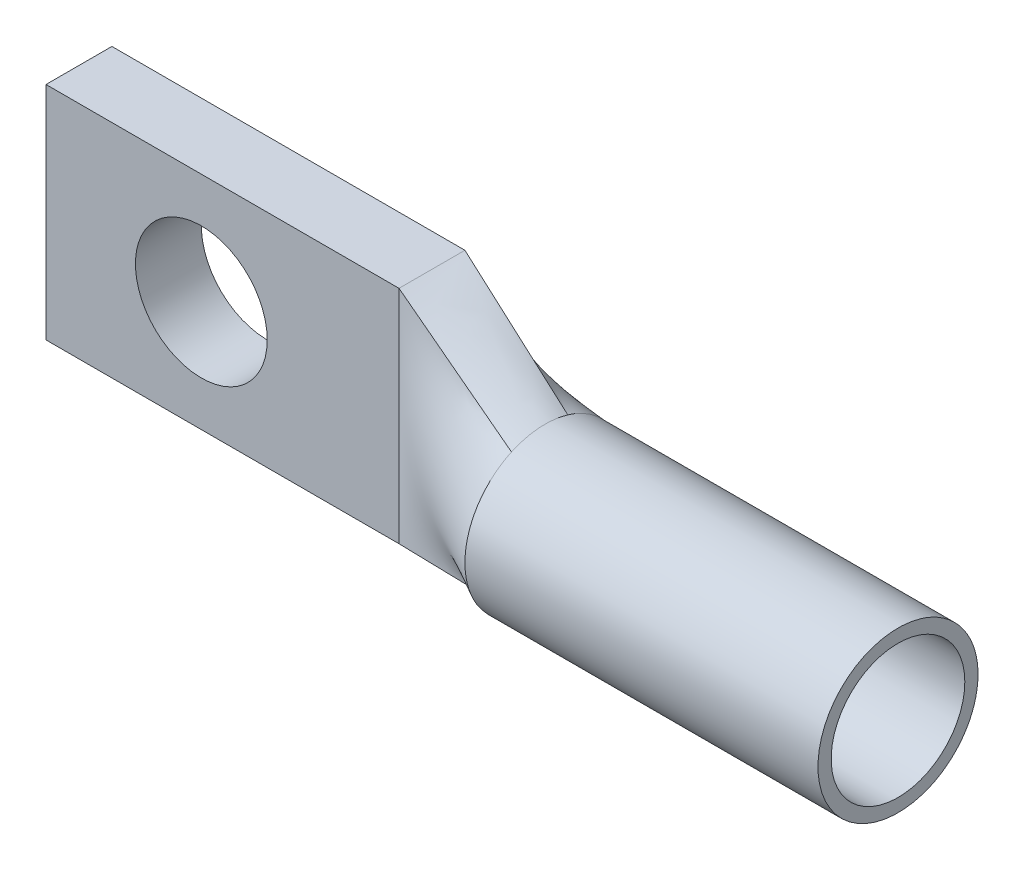
ISO-10303-21;
HEADER;
FILE_DESCRIPTION(('STEP AP214'),'2;1');
FILE_NAME('part.step','',(''),(''),'','','');
FILE_SCHEMA(('AUTOMOTIVE_DESIGN { 1 0 10303 214 1 1 1 1 }'));
ENDSEC;
DATA;
#1=APPLICATION_CONTEXT('core data for automotive mechanical design processes');
#2=APPLICATION_PROTOCOL_DEFINITION('international standard','automotive_design',2000,#1);
#3=PRODUCT_CONTEXT('',#1,'mechanical');
#4=PRODUCT('Part','Part','',(#3));
#5=PRODUCT_RELATED_PRODUCT_CATEGORY('part','',(#4));
#6=PRODUCT_DEFINITION_FORMATION('','',#4);
#7=PRODUCT_DEFINITION_CONTEXT('part definition',#1,'design');
#8=PRODUCT_DEFINITION('design','',#6,#7);
#9=PRODUCT_DEFINITION_SHAPE('','',#8);
#10=(LENGTH_UNIT() NAMED_UNIT(*) SI_UNIT(.MILLI.,.METRE.));
#11=(NAMED_UNIT(*) PLANE_ANGLE_UNIT() SI_UNIT($,.RADIAN.));
#12=(NAMED_UNIT(*) SI_UNIT($,.STERADIAN.) SOLID_ANGLE_UNIT());
#13=UNCERTAINTY_MEASURE_WITH_UNIT(LENGTH_MEASURE(1.E-05),#10,'distance_accuracy_value','');
#14=(GEOMETRIC_REPRESENTATION_CONTEXT(3) GLOBAL_UNCERTAINTY_ASSIGNED_CONTEXT((#13)) GLOBAL_UNIT_ASSIGNED_CONTEXT((#10,
#11,#12)) REPRESENTATION_CONTEXT('',''));
#15=CARTESIAN_POINT('',(0.,0.,0.));
#16=DIRECTION('',(0.,0.,1.));
#17=DIRECTION('',(1.,0.,0.));
#18=AXIS2_PLACEMENT_3D('',#15,#16,#17);
#19=CARTESIAN_POINT('',(-26.9130146414763,9.54872491124754,0.));
#20=DIRECTION('',(-1.,0.,0.));
#21=DIRECTION('',(0.,0.,1.));
#22=AXIS2_PLACEMENT_3D('',#19,#20,#21);
#23=PLANE('',#22);
#24=DIRECTION('',(0.,1.,0.));
#25=VECTOR('',#24,1.);
#26=CARTESIAN_POINT('',(-26.9130146414763,3.57972491124754,0.));
#27=LINE('',#26,#25);
#28=CARTESIAN_POINT('',(-26.9130146414763,9.54872491124754,0.));
#29=VERTEX_POINT('',#28);
#30=CARTESIAN_POINT('',(-26.9130146414763,-2.38927508875246,0.));
#31=VERTEX_POINT('',#30);
#32=EDGE_CURVE('E156',#29,#31,#27,.F.);
#33=ORIENTED_EDGE('',*,*,#32,.F.);
#34=DIRECTION('',(0.,0.,1.));
#35=VECTOR('',#34,1.);
#36=CARTESIAN_POINT('',(-26.9130146414763,9.54872491124754,0.));
#37=LINE('',#36,#35);
#38=CARTESIAN_POINT('',(-26.9130146414763,9.54872491124754,-3.556));
#39=VERTEX_POINT('',#38);
#40=EDGE_CURVE('E118',#39,#29,#37,.T.);
#41=ORIENTED_EDGE('',*,*,#40,.F.);
#42=DIRECTION('',(0.,1.,0.));
#43=VECTOR('',#42,1.);
#44=CARTESIAN_POINT('',(-26.9130146414763,3.57972491124754,-3.556));
#45=LINE('',#44,#43);
#46=CARTESIAN_POINT('',(-26.9130146414763,-2.38927508875246,-3.556));
#47=VERTEX_POINT('',#46);
#48=EDGE_CURVE('E113',#39,#47,#45,.F.);
#49=ORIENTED_EDGE('',*,*,#48,.T.);
#50=DIRECTION('',(0.,0.,-1.));
#51=VECTOR('',#50,1.);
#52=CARTESIAN_POINT('',(-26.9130146414763,-2.38927508875246,0.));
#53=LINE('',#52,#51);
#54=EDGE_CURVE('E116',#31,#47,#53,.T.);
#55=ORIENTED_EDGE('',*,*,#54,.F.);
#56=EDGE_LOOP('',(#33,#41,#49,#55));
#57=FACE_BOUND('',#56,.T.);
#58=ADVANCED_FACE('F40',(#57),#23,.T.);
#59=CARTESIAN_POINT('',(-26.9130146414763,-2.38927508875246,0.));
#60=DIRECTION('',(0.,-1.,0.));
#61=DIRECTION('',(0.,0.,-1.));
#62=AXIS2_PLACEMENT_3D('',#59,#60,#61);
#63=PLANE('',#62);
#64=DIRECTION('',(1.,0.,0.));
#65=VECTOR('',#64,1.);
#66=CARTESIAN_POINT('',(-17.3880146414763,-2.38927508875246,0.));
#67=LINE('',#66,#65);
#68=CARTESIAN_POINT('',(-7.86301464147627,-2.38927508875246,0.));
#69=VERTEX_POINT('',#68);
#70=EDGE_CURVE('E130',#31,#69,#67,.T.);
#71=ORIENTED_EDGE('',*,*,#70,.F.);
#72=ORIENTED_EDGE('',*,*,#54,.T.);
#73=DIRECTION('',(1.,0.,0.));
#74=VECTOR('',#73,1.);
#75=CARTESIAN_POINT('',(-17.3880146414763,-2.38927508875246,-3.556));
#76=LINE('',#75,#74);
#77=CARTESIAN_POINT('',(-7.86301464147627,-2.38927508875246,-3.556));
#78=VERTEX_POINT('',#77);
#79=EDGE_CURVE('E123',#47,#78,#76,.T.);
#80=ORIENTED_EDGE('',*,*,#79,.T.);
#81=DIRECTION('',(0.,0.,1.));
#82=VECTOR('',#81,1.);
#83=CARTESIAN_POINT('',(-7.86301464147627,-2.38927508875247,-1.778));
#84=LINE('',#83,#82);
#85=EDGE_CURVE('E159',#78,#69,#84,.T.);
#86=ORIENTED_EDGE('',*,*,#85,.T.);
#87=EDGE_LOOP('',(#71,#72,#80,#86));
#88=FACE_BOUND('',#87,.T.);
#89=ADVANCED_FACE('F127',(#88),#63,.T.);
#90=CARTESIAN_POINT('',(-17.3880146414763,3.57972491124754,-3.556));
#91=DIRECTION('',(0.,0.,1.));
#92=DIRECTION('',(1.,0.,0.));
#93=AXIS2_PLACEMENT_3D('',#90,#91,#92);
#94=PLANE('',#93);
#95=CARTESIAN_POINT('',(-18.5310146414763,3.57972491124754,-3.556));
#96=DIRECTION('',(0.,0.,1.));
#97=DIRECTION('',(1.,0.,0.));
#98=AXIS2_PLACEMENT_3D('',#95,#96,#97);
#99=CIRCLE('',#98,3.55600000000001);
#100=CARTESIAN_POINT('',(-14.9750146414762,3.57972491124754,-3.556));
#101=VERTEX_POINT('',#100);
#102=EDGE_CURVE('E416',#101,#101,#99,.T.);
#103=ORIENTED_EDGE('',*,*,#102,.T.);
#104=EDGE_LOOP('',(#103));
#105=FACE_BOUND('',#104,.T.);
#106=ORIENTED_EDGE('',*,*,#79,.F.);
#107=ORIENTED_EDGE('',*,*,#48,.F.);
#108=DIRECTION('',(1.,0.,0.));
#109=VECTOR('',#108,1.);
#110=CARTESIAN_POINT('',(-7.86301464147627,9.54872491124754,-3.556));
#111=LINE('',#110,#109);
#112=CARTESIAN_POINT('',(-7.86301464147627,9.54872491124755,-3.55599999999999));
#113=VERTEX_POINT('',#112);
#114=EDGE_CURVE('E139',#113,#39,#111,.F.);
#115=ORIENTED_EDGE('',*,*,#114,.F.);
#116=DIRECTION('',(0.,-1.,0.));
#117=VECTOR('',#116,1.);
#118=CARTESIAN_POINT('',(-7.86301464147627,3.57972491124754,-3.556));
#119=LINE('',#118,#117);
#120=EDGE_CURVE('E137',#113,#78,#119,.T.);
#121=ORIENTED_EDGE('',*,*,#120,.T.);
#122=EDGE_LOOP('',(#106,#107,#115,#121));
#123=FACE_BOUND('',#122,.T.);
#124=ADVANCED_FACE('F135',(#105,#123),#94,.F.);
#125=CARTESIAN_POINT('',(-7.86301464147627,9.54872491124754,0.));
#126=DIRECTION('',(0.,1.,0.));
#127=DIRECTION('',(0.,0.,1.));
#128=AXIS2_PLACEMENT_3D('',#125,#126,#127);
#129=PLANE('',#128);
#130=DIRECTION('',(1.,0.,0.));
#131=VECTOR('',#130,1.);
#132=CARTESIAN_POINT('',(-17.3880146414763,9.54872491124754,0.));
#133=LINE('',#132,#131);
#134=CARTESIAN_POINT('',(-7.86301464147627,9.54872491124755,0.));
#135=VERTEX_POINT('',#134);
#136=EDGE_CURVE('E160',#135,#29,#133,.F.);
#137=ORIENTED_EDGE('',*,*,#136,.F.);
#138=DIRECTION('',(0.,0.,-1.));
#139=VECTOR('',#138,1.);
#140=CARTESIAN_POINT('',(-7.86301464147627,9.54872491124754,-1.778));
#141=LINE('',#140,#139);
#142=EDGE_CURVE('E300',#135,#113,#141,.T.);
#143=ORIENTED_EDGE('',*,*,#142,.T.);
#144=ORIENTED_EDGE('',*,*,#114,.T.);
#145=ORIENTED_EDGE('',*,*,#40,.T.);
#146=EDGE_LOOP('',(#137,#143,#144,#145));
#147=FACE_BOUND('',#146,.T.);
#148=ADVANCED_FACE('F401',(#147),#129,.T.);
#149=CARTESIAN_POINT('',(-17.3880146414763,3.57972491124754,0.));
#150=DIRECTION('',(0.,0.,1.));
#151=DIRECTION('',(1.,0.,0.));
#152=AXIS2_PLACEMENT_3D('',#149,#150,#151);
#153=PLANE('',#152);
#154=CARTESIAN_POINT('',(-18.5310146414763,3.57972491124754,0.));
#155=DIRECTION('',(0.,0.,1.));
#156=DIRECTION('',(1.,0.,0.));
#157=AXIS2_PLACEMENT_3D('',#154,#155,#156);
#158=CIRCLE('',#157,3.55600000000001);
#159=CARTESIAN_POINT('',(-14.9750146414762,3.57972491124754,0.));
#160=VERTEX_POINT('',#159);
#161=EDGE_CURVE('E421',#160,#160,#158,.T.);
#162=ORIENTED_EDGE('',*,*,#161,.F.);
#163=EDGE_LOOP('',(#162));
#164=FACE_BOUND('',#163,.T.);
#165=ORIENTED_EDGE('',*,*,#136,.T.);
#166=ORIENTED_EDGE('',*,*,#32,.T.);
#167=ORIENTED_EDGE('',*,*,#70,.T.);
#168=DIRECTION('',(0.,1.,0.));
#169=VECTOR('',#168,1.);
#170=CARTESIAN_POINT('',(-7.86301464147627,3.57972491124754,0.));
#171=LINE('',#170,#169);
#172=EDGE_CURVE('E250',#69,#135,#171,.T.);
#173=ORIENTED_EDGE('',*,*,#172,.T.);
#174=EDGE_LOOP('',(#165,#166,#167,#173));
#175=FACE_BOUND('',#174,.T.);
#176=ADVANCED_FACE('F399',(#164,#175),#153,.T.);
#177=CARTESIAN_POINT('',(-7.86301464147627,-2.38927508875246,-3.556));
#178=CARTESIAN_POINT('',(-4.98434797480961,-1.77904488266098,-2.52756263364651));
#179=CARTESIAN_POINT('',(-2.10568130814296,-1.16881467656948,-1.499125267293));
#180=CARTESIAN_POINT('',(0.772985358523727,-0.558584470477974,-0.470687900939511));
#181=CARTESIAN_POINT('',(-7.86301464147627,-2.38927508875246,-2.87866666666666));
#182=CARTESIAN_POINT('',(-4.98434797480961,-1.82445116110742,-1.92388654616813));
#183=CARTESIAN_POINT('',(-2.10568130814293,-1.25935798810563,-0.969065826496424));
#184=CARTESIAN_POINT('',(0.772985358523727,-0.694534060460597,-0.014285705997873));
#185=CARTESIAN_POINT('',(-7.86301464147627,-2.38927508875248,-1.69333333333334));
#186=CARTESIAN_POINT('',(-4.98434797480961,-1.85914511701632,-0.854218296992577));
#187=CARTESIAN_POINT('',(-2.10568130814296,-1.32916088832101,-0.0151097751119362));
#188=CARTESIAN_POINT('',(0.772985358523727,-0.799030916584856,0.824005261228828));
#189=CARTESIAN_POINT('',(-7.86301464147627,-2.38927508875246,-0.508));
#190=CARTESIAN_POINT('',(-4.98434797480961,-1.8130414794771,0.212137821083555));
#191=CARTESIAN_POINT('',(-2.10568130814296,-1.2367802722403,0.932248433649721));
#192=CARTESIAN_POINT('',(0.772985358523727,-0.660546662964941,1.65238625473328));
#193=CARTESIAN_POINT('',(-7.86301464147627,-2.38927508875246,0.));
#194=CARTESIAN_POINT('',(-4.98434797480961,-1.77904488266098,0.664895966979829));
#195=CARTESIAN_POINT('',(-2.10568130814296,-1.16881467656948,1.32979193395968));
#196=CARTESIAN_POINT('',(0.772985358523727,-0.558584470477974,1.99468790093951));
#197=B_SPLINE_SURFACE_WITH_KNOTS('',3,3,((#177,#178,#179,#180),(#181,#182,#183,#184),(#185,#186,
#187,#188),(#189,#190,#191,#192),(#193,#194,#195,#196)),.UNSPECIFIED.,.F.,.F.,.F.,(4,1,4),(4,4),
(0.,0.571428571428571,1.),(0.,1.),.UNSPECIFIED.);
#198=DIRECTION('',(0.923485450897874,0.19576379702081,0.329925988300323));
#199=VECTOR('',#198,1.);
#200=CARTESIAN_POINT('',(-3.54501464147628,-1.47392977961521,-2.01334395046975));
#201=LINE('',#200,#199);
#202=CARTESIAN_POINT('',(0.772985358523727,-0.55858447047797,-0.470687900939503));
#203=VERTEX_POINT('',#202);
#204=EDGE_CURVE('E291',#78,#203,#201,.T.);
#205=CARTESIAN_POINT('',(0.772985358523727,-0.558584470477974,-0.470687900939511));
#206=CARTESIAN_POINT('',(0.772985358523727,-0.694534060460597,-0.014285705997873));
#207=CARTESIAN_POINT('',(0.772985358523727,-0.799030916584856,0.824005261228828));
#208=CARTESIAN_POINT('',(0.772985358523727,-0.660546662964941,1.65238625473328));
#209=CARTESIAN_POINT('',(0.772985358523727,-0.558584470477974,1.99468790093951));
#210=B_SPLINE_CURVE_WITH_KNOTS('',3,(#205,#206,#207,#208,#209),.UNSPECIFIED.,.F.,.F.,(4,1,4),
(0.,0.571428571428571,1.),.UNSPECIFIED.);
#211=CARTESIAN_POINT('',(0.772985358523728,-0.558584470477971,1.99468790093951));
#212=VERTEX_POINT('',#211);
#213=EDGE_CURVE('E240',#212,#203,#210,.F.);
#214=DIRECTION('',(-0.95420635464948,-0.20227612567794,-0.220396464870184));
#215=VECTOR('',#214,1.);
#216=CARTESIAN_POINT('',(-3.54501464147628,-1.47392977961523,0.997343950469751));
#217=LINE('',#216,#215);
#218=EDGE_CURVE('E256',#212,#69,#217,.T.);
#219=ORIENTED_EDGE('',*,*,#204,.T.);
#220=ORIENTED_EDGE('',*,*,#213,.F.);
#221=ORIENTED_EDGE('',*,*,#218,.T.);
#222=ORIENTED_EDGE('',*,*,#85,.F.);
#223=EDGE_LOOP('',(#219,#220,#221,#222));
#224=FACE_BOUND('',#223,.T.);
#225=ADVANCED_FACE('F290',(#224),#197,.F.);
#226=CARTESIAN_POINT('',(-7.86301464147627,9.54872491124754,-3.556));
#227=CARTESIAN_POINT('',(-5.80682416528579,9.11284619261074,-2.82140188117609));
#228=CARTESIAN_POINT('',(-2.92815749861914,8.50261598651926,-1.79296451482257));
#229=CARTESIAN_POINT('',(-0.049490831952479,7.89238578042775,-0.764527148469086));
#230=CARTESIAN_POINT('',(0.772985358523727,7.71803429297303,-0.470687900939511));
#231=CARTESIAN_POINT('',(-7.86301464147627,9.26448681600943,-3.556));
#232=CARTESIAN_POINT('',(-5.80682416528579,8.89121093440309,-2.83830552964807));
#233=CARTESIAN_POINT('',(-2.92815749861914,8.36873169182097,-1.83356864729985));
#234=CARTESIAN_POINT('',(-0.049490831952479,7.84618287920159,-0.828808762041543));
#235=CARTESIAN_POINT('',(0.772985358523727,7.69687252655906,-0.541730973900782));
#236=CARTESIAN_POINT('',(-7.86301464147627,8.69601062553325,-3.556));
#237=CARTESIAN_POINT('',(-5.80682416528579,8.44171105621816,-2.89097698580464));
#238=CARTESIAN_POINT('',(-2.92815749861914,8.08565240716396,-1.95993651317235));
#239=CARTESIAN_POINT('',(-0.049490831952479,7.72961928125653,-1.02890140679665));
#240=CARTESIAN_POINT('',(0.772985358523727,7.6278994535305,-0.762892201118515));
#241=CARTESIAN_POINT('',(-7.86301464147627,7.84329633981895,-3.556));
#242=CARTESIAN_POINT('',(-5.80682416528579,7.7386826265043,-3.0136726578441));
#243=CARTESIAN_POINT('',(-2.92815749861914,7.59229598776747,-2.25440178901738));
#244=CARTESIAN_POINT('',(-0.049490831952479,7.44586216783087,-1.49513910656135));
#245=CARTESIAN_POINT('',(0.772985358523727,7.40401668250499,-1.27820816969899));
#246=CARTESIAN_POINT('',(-7.86301464147627,6.99058205410468,-3.556));
#247=CARTESIAN_POINT('',(-5.80682416528579,6.99481324780753,-3.16283937494644));
#248=CARTESIAN_POINT('',(-2.92815749861914,7.00069931193934,-2.61242344811388));
#249=CARTESIAN_POINT('',(-0.049490831952479,7.00660982960197,-2.0620017027949));
#250=CARTESIAN_POINT('',(0.772985358523727,7.0083023070831,-1.90473745277346));
#251=CARTESIAN_POINT('',(-7.86301464147627,6.13786776839038,-3.556));
#252=CARTESIAN_POINT('',(-5.80682416528579,6.20111424522799,-3.31638767685563));
#253=CARTESIAN_POINT('',(-2.92815749861914,6.28963350657801,-2.98096285423814));
#254=CARTESIAN_POINT('',(-0.049490831952479,6.37816954811215,-2.64551694454542));
#255=CARTESIAN_POINT('',(0.772985358523727,6.4034681388472,-2.54967201528765));
#256=CARTESIAN_POINT('',(-7.86301464147627,5.28515348267611,-3.556));
#257=CARTESIAN_POINT('',(-5.80682416528579,5.35646375526414,-3.44941250922374));
#258=CARTESIAN_POINT('',(-2.92815749861914,5.45625796034488,-3.30014879414651));
#259=CARTESIAN_POINT('',(-0.049490831952479,5.55607828973646,-3.15091188707144));
#260=CARTESIAN_POINT('',(0.772985358523727,5.58460239877167,-3.10827689076094));
#261=CARTESIAN_POINT('',(-7.86301464147627,4.43243919696181,-3.556));
#262=CARTESIAN_POINT('',(-5.80682416528579,4.47015112387027,-3.53844153310004));
#263=CARTESIAN_POINT('',(-2.92815749861914,4.52299635946526,-3.51402367200728));
#264=CARTESIAN_POINT('',(-0.049490831952479,4.57581003386277,-3.48949917673117));
#265=CARTESIAN_POINT('',(0.772985358523727,4.59089480462617,-3.48247578997119));
#266=CARTESIAN_POINT('',(-7.86301464147627,3.57972491124754,-3.556));
#267=CARTESIAN_POINT('',(-5.80682416528579,3.56115235888259,-3.56685178090021));
#268=CARTESIAN_POINT('',(-2.92815749861914,3.53514819574111,-3.58193353918644));
#269=CARTESIAN_POINT('',(-0.049490831952479,3.50914571660563,-3.59708730155025));
#270=CARTESIAN_POINT('',(0.772985358523727,3.50171669565964,-3.60142801391034));
#271=CARTESIAN_POINT('',(-7.86301464147627,2.72701062553325,-3.556));
#272=CARTESIAN_POINT('',(-5.80682416528579,2.65409191796643,-3.52927288343374));
#273=CARTESIAN_POINT('',(-2.92815749861914,2.55196924889473,-3.49194012611279));
#274=CARTESIAN_POINT('',(-0.049490831952479,2.44987029951226,-3.45455196470422));
#275=CARTESIAN_POINT('',(0.772985358523727,2.42070281648555,-3.44386111807773));
#276=CARTESIAN_POINT('',(-7.86301464147627,1.87429633981895,-3.556));
#277=CARTESIAN_POINT('',(-5.80682416528579,1.77309285924948,-3.43302460839646));
#278=CARTESIAN_POINT('',(-2.92815749861914,1.63143820635981,-3.26082737344656));
#279=CARTESIAN_POINT('',(-0.049490831952479,1.48976390334073,-3.08865074239332));
#280=CARTESIAN_POINT('',(0.772985358523727,1.44928251111295,-3.03946058575191));
#281=CARTESIAN_POINT('',(-7.86301464147627,1.02158205410468,-3.556));
#282=CARTESIAN_POINT('',(-5.80682416528579,0.935799468979056,-3.29616658398194));
#283=CARTESIAN_POINT('',(-2.92815749861914,0.815693821492,-2.93241945681674));
#284=CARTESIAN_POINT('',(-0.049490831952479,0.695594694792995,-2.56865954905643));
#285=CARTESIAN_POINT('',(0.772985358523727,0.661281660742745,-2.46472618264921));
#286=CARTESIAN_POINT('',(-7.86301464147627,0.168867768390382,-3.556));
#287=CARTESIAN_POINT('',(-5.80682416528579,0.149844104265447,-3.14271329995362));
#288=CARTESIAN_POINT('',(-2.92815749861914,0.123226736379435,-2.5641370876414));
#289=CARTESIAN_POINT('',(-0.049490831952479,0.0965991195158018,-1.98554451030238));
#290=CARTESIAN_POINT('',(0.772985358523727,0.0889896538658278,-1.82022983028383));
#291=CARTESIAN_POINT('',(-7.86301464147627,-0.541727469704844,-3.556));
#292=CARTESIAN_POINT('',(-5.80682416528579,-0.464463197391432,-3.0216103481077));
#293=CARTESIAN_POINT('',(-2.92815749861914,-0.356329417529605,-2.27347460833956));
#294=CARTESIAN_POINT('',(-0.049490831952479,-0.248172098160272,-1.5253325138737));
#295=CARTESIAN_POINT('',(0.772985358523727,-0.217266389234907,-1.31157665311678));
#296=CARTESIAN_POINT('',(-7.86301464147627,-1.11020366018105,-3.556));
#297=CARTESIAN_POINT('',(-5.80682416528579,-0.936368644750532,-2.93945232054065));
#298=CARTESIAN_POINT('',(-2.92815749861914,-0.693056369003489,-2.07628213620786));
#299=CARTESIAN_POINT('',(-0.049490831952479,-0.449707194950131,-1.21311418420015));
#300=CARTESIAN_POINT('',(0.772985358523727,-0.380173188777908,-0.966495112416399));
#301=CARTESIAN_POINT('',(-7.86301464147627,-1.67867985065723,-3.556));
#302=CARTESIAN_POINT('',(-5.80682416528579,-1.3972745941928,-2.86991641256047));
#303=CARTESIAN_POINT('',(-2.92815749861914,-1.00331070289376,-1.90941764513731));
#304=CARTESIAN_POINT('',(-0.049490831952479,-0.609344556731436,-0.948907007626283));
#305=CARTESIAN_POINT('',(0.772985358523727,-0.496782454145678,-0.674473572650487));
#306=CARTESIAN_POINT('',(-7.86301464147627,-2.10503699351437,-3.556));
#307=CARTESIAN_POINT('',(-5.80682416528579,-1.73273670280102,-2.83496432971194));
#308=CARTESIAN_POINT('',(-2.92815749861914,-1.21167558254826,-1.82557958095756));
#309=CARTESIAN_POINT('',(-0.049490831952479,-0.690510888015493,-0.81615244342243));
#310=CARTESIAN_POINT('',(0.772985358523727,-0.541590771730158,-0.527738175307213));
#311=CARTESIAN_POINT('',(-7.86301464147627,-2.38927508875246,-3.556));
#312=CARTESIAN_POINT('',(-5.80682416528579,-1.95339637011568,-2.82140188117606));
#313=CARTESIAN_POINT('',(-2.92815749861914,-1.34316616402417,-1.79296451482257));
#314=CARTESIAN_POINT('',(-0.049490831952479,-0.732935957932696,-0.764527148469086));
#315=CARTESIAN_POINT('',(0.772985358523727,-0.558584470477974,-0.470687900939511));
#316=B_SPLINE_SURFACE_WITH_KNOTS('',3,3,((#226,#227,#228,#229,#230),(#231,#232,#233,#234,#235),
(#236,#237,#238,#239,#240),(#241,#242,#243,#244,#245),(#246,#247,#248,#249,#250),(#251,#252,
#253,#254,#255),(#256,#257,#258,#259,#260),(#261,#262,#263,#264,#265),(#266,#267,#268,#269,
#270),(#271,#272,#273,#274,#275),(#276,#277,#278,#279,#280),(#281,#282,#283,#284,#285),(#286,
#287,#288,#289,#290),(#291,#292,#293,#294,#295),(#296,#297,#298,#299,#300),(#301,#302,#303,#304,
#305),(#306,#307,#308,#309,#310),(#311,#312,#313,#314,#315)),.UNSPECIFIED.,.F.,.F.,.F.,(4,1,1,1,
1,1,1,1,1,1,1,1,1,1,1,4),(4,1,4),(0.,0.071428571428571,0.142857142857143,0.214285714285714,
0.285714285714286,0.357142857142857,0.428571428571429,0.5,0.571428571428571,0.642857142857143,
0.714285714285714,0.785714285714286,0.857142857142857,0.892857142857143,0.928571428571429,1.),
(0.,0.714285714285714,1.),.UNSPECIFIED.);
#317=DIRECTION('',(0.923485450897876,-0.195763797020815,0.329925988300317));
#318=VECTOR('',#317,1.);
#319=CARTESIAN_POINT('',(-3.54501464147628,8.63337960211029,-2.01334395046976));
#320=LINE('',#319,#318);
#321=CARTESIAN_POINT('',(0.772985358509005,7.71803429297616,-0.470687900944773));
#322=VERTEX_POINT('',#321);
#323=EDGE_CURVE('E305',#113,#322,#320,.T.);
#324=CARTESIAN_POINT('',(0.772985358435394,7.71803429299176,-0.470687900971069));
#325=CARTESIAN_POINT('',(0.772985358435394,7.69687252657509,-0.541730973931615));
#326=CARTESIAN_POINT('',(0.772985358435394,7.62789945354142,-0.762892201147084));
#327=CARTESIAN_POINT('',(0.772985358435394,7.40401668250948,-1.27820816972229));
#328=CARTESIAN_POINT('',(0.772985358435394,7.00830230708292,-1.90473745279035));
#329=CARTESIAN_POINT('',(0.772985358435394,6.40346813884448,-2.54967201529795));
#330=CARTESIAN_POINT('',(0.772985358435394,5.58460239876861,-3.10827689076552));
#331=CARTESIAN_POINT('',(0.772985358435394,4.59089480462454,-3.48247578997195));
#332=CARTESIAN_POINT('',(0.772985358435394,3.50171669566044,-3.60142801390987));
#333=CARTESIAN_POINT('',(0.772985358435394,2.42070281648868,-3.44386111807888));
#334=CARTESIAN_POINT('',(0.772985358435394,1.4492825111173,-3.0394605857572));
#335=CARTESIAN_POINT('',(0.772985358435394,0.661281660746431,-2.46472618266037));
#336=CARTESIAN_POINT('',(0.772985358435394,0.088989653866645,-1.82022983030159));
#337=CARTESIAN_POINT('',(0.772985358435394,-0.217266389238226,-1.31157665313974));
#338=CARTESIAN_POINT('',(0.772985358435394,-0.380173188785376,-0.966495112442886));
#339=CARTESIAN_POINT('',(0.772985358435394,-0.496782454157767,-0.674473572679961));
#340=CARTESIAN_POINT('',(0.772985358435394,-0.541590771746152,-0.527738175338188));
#341=CARTESIAN_POINT('',(0.772985358435394,-0.558584470496699,-0.470687900971069));
#342=B_SPLINE_CURVE_WITH_KNOTS('',3,(#324,#325,#326,#327,#328,#329,#330,#331,#332,#333,#334,
#335,#336,#337,#338,#339,#340,#341),.UNSPECIFIED.,.F.,.F.,(4,1,1,1,1,1,1,1,1,1,1,1,1,1,1,4),(0.,
0.071428571428571,0.142857142857143,0.214285714285714,0.285714285714286,0.357142857142857,
0.428571428571429,0.5,0.571428571428571,0.642857142857143,0.714285714285714,0.785714285714286,
0.857142857142857,0.892857142857143,0.928571428571429,1.),.UNSPECIFIED.);
#343=CARTESIAN_POINT('',(0.772985358501644,3.57972491254267,-3.55600835009297));
#344=VERTEX_POINT('',#343);
#345=EDGE_CURVE('E248',#344,#322,#342,.F.);
#346=CARTESIAN_POINT('',(0.772985358523752,3.57972491383781,-3.55601670018595));
#347=CARTESIAN_POINT('',(0.772985358523752,3.57093988890131,-3.55601806101919));
#348=CARTESIAN_POINT('',(0.772985358523752,3.5621548590265,-3.55599240108888));
#349=CARTESIAN_POINT('',(0.772985358523752,3.54458545994635,-3.55588692874846));
#350=CARTESIAN_POINT('',(0.772985358523752,3.5358010907286,-3.55580711840621));
#351=CARTESIAN_POINT('',(0.772985358523752,3.51823350706714,-3.55559324043091));
#352=CARTESIAN_POINT('',(0.772985358523752,3.50945029258627,-3.55545917585269));
#353=CARTESIAN_POINT('',(0.772985358523752,3.49188551197139,-3.5551367025491));
#354=CARTESIAN_POINT('',(0.772985358523752,3.48310394576349,-3.55494829784862));
#355=CARTESIAN_POINT('',(0.772985358523752,3.46554294664172,-3.55451729715797));
#356=CARTESIAN_POINT('',(0.772985358523752,3.45676351360623,-3.55427470612187));
#357=CARTESIAN_POINT('',(0.772985358523752,3.43920726485626,-3.55373547019886));
#358=CARTESIAN_POINT('',(0.772985358523752,3.43043044896086,-3.55343883120125));
#359=CARTESIAN_POINT('',(0.772985358523752,3.41287991865967,-3.55279164115054));
#360=CARTESIAN_POINT('',(0.772985358523752,3.40410620400184,-3.55244109693119));
#361=CARTESIAN_POINT('',(0.772985358523752,3.38656235991736,-3.55168623615809));
#362=CARTESIAN_POINT('',(0.772985358523752,3.37779223015564,-3.55128192739206));
#363=CARTESIAN_POINT('',(0.772985358523752,3.36902342122938,-3.55085076913025));
#364=B_SPLINE_CURVE_WITH_KNOTS('',3,(#346,#347,#348,#349,#350,#351,#352,#353,#354,#355,#356,
#357,#358,#359,#360,#361,#362,#363),.UNSPECIFIED.,.F.,.F.,(4,2,2,2,2,2,2,2,4),(0.,
0.026355034666313,0.0527090629634775,0.0790616075827586,0.105412200802668,0.131760385862809,
0.158105701623138,0.184447680243513,0.210785847416329),.UNSPECIFIED.);
#365=CARTESIAN_POINT('',(0.772985358523727,3.36902328723533,-3.55085349426256));
#366=VERTEX_POINT('',#365);
#367=EDGE_CURVE('E174',#366,#344,#364,.F.);
#368=CARTESIAN_POINT('',(0.772985358523727,7.71803429297303,-0.470687900939511));
#369=CARTESIAN_POINT('',(0.772985358523727,7.69687252655906,-0.541730973900782));
#370=CARTESIAN_POINT('',(0.772985358523727,7.6278994535305,-0.762892201118515));
#371=CARTESIAN_POINT('',(0.772985358523727,7.40401668250499,-1.27820816969899));
#372=CARTESIAN_POINT('',(0.772985358523727,7.0083023070831,-1.90473745277346));
#373=CARTESIAN_POINT('',(0.772985358523727,6.4034681388472,-2.54967201528765));
#374=CARTESIAN_POINT('',(0.772985358523727,5.58460239877167,-3.10827689076094));
#375=CARTESIAN_POINT('',(0.772985358523727,4.59089480462617,-3.48247578997119));
#376=CARTESIAN_POINT('',(0.772985358523727,3.50171669565964,-3.60142801391034));
#377=CARTESIAN_POINT('',(0.772985358523727,2.42070281648555,-3.44386111807773));
#378=CARTESIAN_POINT('',(0.772985358523727,1.44928251111295,-3.03946058575191));
#379=CARTESIAN_POINT('',(0.772985358523727,0.661281660742745,-2.46472618264921));
#380=CARTESIAN_POINT('',(0.772985358523727,0.0889896538658278,-1.82022983028383));
#381=CARTESIAN_POINT('',(0.772985358523727,-0.217266389234907,-1.31157665311678));
#382=CARTESIAN_POINT('',(0.772985358523727,-0.380173188777908,-0.966495112416399));
#383=CARTESIAN_POINT('',(0.772985358523727,-0.496782454145678,-0.674473572650487));
#384=CARTESIAN_POINT('',(0.772985358523727,-0.541590771730158,-0.527738175307213));
#385=CARTESIAN_POINT('',(0.772985358523727,-0.558584470477974,-0.470687900939511));
#386=B_SPLINE_CURVE_WITH_KNOTS('',3,(#368,#369,#370,#371,#372,#373,#374,#375,#376,#377,#378,
#379,#380,#381,#382,#383,#384,#385),.UNSPECIFIED.,.F.,.F.,(4,1,1,1,1,1,1,1,1,1,1,1,1,1,1,4),(0.,
0.071428571428571,0.142857142857143,0.214285714285714,0.285714285714286,0.357142857142857,
0.428571428571429,0.5,0.571428571428571,0.642857142857143,0.714285714285714,0.785714285714286,
0.857142857142857,0.892857142857143,0.928571428571429,1.),.UNSPECIFIED.);
#387=EDGE_CURVE('E238',#203,#366,#386,.F.);
#388=ORIENTED_EDGE('',*,*,#120,.F.);
#389=ORIENTED_EDGE('',*,*,#323,.T.);
#390=ORIENTED_EDGE('',*,*,#345,.F.);
#391=ORIENTED_EDGE('',*,*,#367,.F.);
#392=ORIENTED_EDGE('',*,*,#387,.F.);
#393=ORIENTED_EDGE('',*,*,#204,.F.);
#394=EDGE_LOOP('',(#388,#389,#390,#391,#392,#393));
#395=FACE_BOUND('',#394,.T.);
#396=ADVANCED_FACE('F339',(#395),#316,.F.);
#397=CARTESIAN_POINT('',(-7.86301464147627,9.54872491124754,0.));
#398=CARTESIAN_POINT('',(-4.98434797480961,8.86645086070289,0.856000823715451));
#399=CARTESIAN_POINT('',(-2.10568130814296,8.18417681015825,1.71200164743088));
#400=CARTESIAN_POINT('',(0.772985358523727,7.5019027596136,2.56800247114633));
#401=CARTESIAN_POINT('',(-7.86301464147627,9.54872491124754,-0.677333333333342));
#402=CARTESIAN_POINT('',(-4.98434797480961,8.94933935427175,0.224946941466584));
#403=CARTESIAN_POINT('',(-2.10568130814296,8.349319971047,1.12706055199669));
#404=CARTESIAN_POINT('',(0.772985358523727,7.74993441407121,2.02934082679661));
#405=CARTESIAN_POINT('',(-7.86301464147627,9.54872491124754,-1.86266666666666));
#406=CARTESIAN_POINT('',(-4.98434797480961,9.02796363884448,-0.909670830474411));
#407=CARTESIAN_POINT('',(-2.10568130814296,8.50751804237433,0.0433681631101348));
#408=CARTESIAN_POINT('',(0.772985358523727,7.9867567699713,0.996363999302382));
#409=CARTESIAN_POINT('',(-7.86301464147627,9.54872491124754,-3.048));
#410=CARTESIAN_POINT('',(-4.98434797480961,8.98084168451337,-2.04683531162937));
#411=CARTESIAN_POINT('',(-2.10568130814296,8.41288811819115,-1.04559415154257));
#412=CARTESIAN_POINT('',(0.772985358523727,7.84500489145698,-0.0444294631719602));
#413=CARTESIAN_POINT('',(-7.86301464147627,9.54872491124754,-3.556));
#414=CARTESIAN_POINT('',(-4.98434797480961,8.93849470515604,-2.52756263364651));
#415=CARTESIAN_POINT('',(-2.10568130814296,8.32826449906454,-1.499125267293));
#416=CARTESIAN_POINT('',(0.772985358523727,7.71803429297303,-0.470687900939511));
#417=B_SPLINE_SURFACE_WITH_KNOTS('',3,3,((#397,#398,#399,#400),(#401,#402,#403,#404),(#405,#406,
#407,#408),(#409,#410,#411,#412),(#413,#414,#415,#416)),.UNSPECIFIED.,.F.,.F.,.F.,(4,1,4),(4,4),
(0.,0.571428571428571,1.),(0.,1.),.UNSPECIFIED.);
#418=DIRECTION('',(0.934703123997568,-0.221534397799877,0.277943484508329));
#419=VECTOR('',#418,1.);
#420=CARTESIAN_POINT('',(-3.54501464147628,8.52531383543055,1.28400123557316));
#421=LINE('',#420,#419);
#422=CARTESIAN_POINT('',(0.772985358523727,7.50190275961358,2.56800247114633));
#423=VERTEX_POINT('',#422);
#424=EDGE_CURVE('E287',#135,#423,#421,.T.);
#425=CARTESIAN_POINT('',(0.772985358523727,7.5019027596136,2.56800247114633));
#426=CARTESIAN_POINT('',(0.772985358523727,7.74993441407121,2.02934082679661));
#427=CARTESIAN_POINT('',(0.772985358523727,7.9867567699713,0.996363999302382));
#428=CARTESIAN_POINT('',(0.772985358523727,7.84500489145698,-0.0444294631719602));
#429=CARTESIAN_POINT('',(0.772985358523727,7.71803429297303,-0.470687900939511));
#430=B_SPLINE_CURVE_WITH_KNOTS('',3,(#425,#426,#427,#428,#429),.UNSPECIFIED.,.F.,.F.,(4,1,4),
(0.,0.571428571428571,1.),.UNSPECIFIED.);
#431=EDGE_CURVE('E311',#322,#423,#430,.F.);
#432=ORIENTED_EDGE('',*,*,#424,.T.);
#433=ORIENTED_EDGE('',*,*,#431,.F.);
#434=ORIENTED_EDGE('',*,*,#323,.F.);
#435=ORIENTED_EDGE('',*,*,#142,.F.);
#436=EDGE_LOOP('',(#432,#433,#434,#435));
#437=FACE_BOUND('',#436,.T.);
#438=ADVANCED_FACE('F350',(#437),#417,.F.);
#439=CARTESIAN_POINT('',(-7.86301464147627,-2.38927508875246,0.));
#440=CARTESIAN_POINT('',(-5.80682416528579,-1.95339637011568,0.474925690699881));
#441=CARTESIAN_POINT('',(-2.92815749861914,-1.3431661640242,1.13982165767971));
#442=CARTESIAN_POINT('',(-0.049490831952479,-0.732935957932696,1.80471762465956));
#443=CARTESIAN_POINT('',(0.772985358523727,-0.558584470477974,1.99468790093951));
#444=CARTESIAN_POINT('',(-7.86301464147627,-2.10503699351437,0.));
#445=CARTESIAN_POINT('',(-5.80682416528579,-1.73275574084664,0.488499516962741));
#446=CARTESIAN_POINT('',(-2.92815749861914,-1.21166060597635,1.17242820161203));
#447=CARTESIAN_POINT('',(-0.049490831952479,-0.690503272797245,1.85633836852211));
#448=CARTESIAN_POINT('',(0.772985358523727,-0.541590771730158,2.05173817530721));
#449=CARTESIAN_POINT('',(-7.86301464147627,-1.53656080303819,0.));
#450=CARTESIAN_POINT('',(-5.80682416528579,-1.28582328881109,0.533629443209515));
#451=CARTESIAN_POINT('',(-2.92815749861914,-0.934755058133846,1.28070423002172));
#452=CARTESIAN_POINT('',(-0.049490831952479,-0.58370935001196,2.02778307451687));
#453=CARTESIAN_POINT('',(0.772985358523727,-0.483414344321143,2.24123485180068));
#454=CARTESIAN_POINT('',(-7.86301464147627,-0.68384651732389,0.));
#455=CARTESIAN_POINT('',(-5.80682416528579,-0.590421718152399,0.64398685377157));
#456=CARTESIAN_POINT('',(-2.92815749861914,-0.459686031041415,1.54555688476453));
#457=CARTESIAN_POINT('',(-0.049490831952479,-0.328913112983431,2.44713420928202));
#458=CARTESIAN_POINT('',(0.772985358523727,-0.291543193314835,2.70472895079067));
#459=CARTESIAN_POINT('',(-7.86301464147627,0.168867768390382,0.));
#460=CARTESIAN_POINT('',(-5.80682416528579,0.140420129474877,0.782212320725062));
#461=CARTESIAN_POINT('',(-2.92815749861914,0.100622286492617,1.87731766425691));
#462=CARTESIAN_POINT('',(-0.049490831952479,0.0608062470478164,2.97241790262703));
#463=CARTESIAN_POINT('',(0.772985358523727,0.0494271914816144,3.28530283091706));
#464=CARTESIAN_POINT('',(-7.86301464147627,1.02158205410468,0.));
#465=CARTESIAN_POINT('',(-5.80682416528579,0.915308846606077,0.929408970161121));
#466=CARTESIAN_POINT('',(-2.92815749861914,0.76654068265471,2.23060933431668));
#467=CARTESIAN_POINT('',(-0.049490831952479,0.617763483038838,3.53179216144392));
#468=CARTESIAN_POINT('',(0.772985358523727,0.575254200039413,3.90355574950837));
#469=CARTESIAN_POINT('',(-7.86301464147627,1.87429633981895,0.));
#470=CARTESIAN_POINT('',(-5.80682416528579,1.73683727500453,1.06395493441526));
#471=CARTESIAN_POINT('',(-2.92815749861914,1.54443041298281,2.55345940214822));
#472=CARTESIAN_POINT('',(-0.049490831952479,1.3520009540096,4.04298432987166));
#473=CARTESIAN_POINT('',(0.772985358523727,1.29701732808383,4.46856630363776));
#474=CARTESIAN_POINT('',(-7.86301464147627,2.72701062553325,0.));
#475=CARTESIAN_POINT('',(-5.80682416528579,2.59908866711877,1.16466496557798));
#476=CARTESIAN_POINT('',(-2.92815749861914,2.41993988240448,2.79532310031895));
#477=CARTESIAN_POINT('',(-0.049490831952479,2.2408277050102,4.4259010215703));
#478=CARTESIAN_POINT('',(0.772985358523727,2.18965892164442,4.89176700780149));
#479=CARTESIAN_POINT('',(-7.86301464147627,3.57972491124754,0.));
#480=CARTESIAN_POINT('',(-5.80682416528579,3.48760287814936,1.21514298030814));
#481=CARTESIAN_POINT('',(-2.92815749861914,3.35864725950884,2.91625228675732));
#482=CARTESIAN_POINT('',(-0.049490831952479,3.22968203685392,4.61741890182031));
#483=CARTESIAN_POINT('',(0.772985358523727,3.19283322361463,5.10347609394358));
#484=CARTESIAN_POINT('',(-7.86301464147627,4.43243919696181,0.));
#485=CARTESIAN_POINT('',(-5.80682416528579,4.3820416675509,1.2077009780941));
#486=CARTESIAN_POINT('',(-2.92815749861914,4.31150300981486,2.8985568331644));
#487=CARTESIAN_POINT('',(-0.049490831952479,4.24095307310414,4.5893657105394));
#488=CARTESIAN_POINT('',(0.772985358523727,4.22079406133978,5.07244610177704));
#489=CARTESIAN_POINT('',(-7.8630146414763,5.28515348267611,0.));
#490=CARTESIAN_POINT('',(-5.80682416528582,5.26087095868108,1.14525921424349));
#491=CARTESIAN_POINT('',(-2.92815749861914,5.22685377843087,2.74859013496357));
#492=CARTESIAN_POINT('',(-0.049490831952479,5.19285025059366,4.35194122478071));
#493=CARTESIAN_POINT('',(0.772985358523727,5.18313724099564,4.81004491047811));
#494=CARTESIAN_POINT('',(-7.86301464147627,6.13786776839038,0.));
#495=CARTESIAN_POINT('',(-5.80682416528579,6.10639171296517,1.04062588218039));
#496=CARTESIAN_POINT('',(-2.92815749861914,6.0623298529672,2.49751837766293));
#497=CARTESIAN_POINT('',(-0.049490831952479,6.01826508067911,3.95440061779267));
#498=CARTESIAN_POINT('',(0.772985358523727,6.005674658509,4.37065097066485));
#499=CARTESIAN_POINT('',(-7.86301464147627,6.99058205410468,0.));
#500=CARTESIAN_POINT('',(-5.80682416528582,6.90833230102602,0.913212697640091));
#501=CARTESIAN_POINT('',(-2.92815749861914,6.79316093232234,2.1917256144967));
#502=CARTESIAN_POINT('',(-0.049490831952479,6.6780032587526,3.47022898254761));
#503=CARTESIAN_POINT('',(0.772985358523727,6.64510335752114,3.83551406160365));
#504=CARTESIAN_POINT('',(-7.86301464147627,7.7011772921999,0.));
#505=CARTESIAN_POINT('',(-5.80682416528579,7.53881312982065,0.806237071486005));
#506=CARTESIAN_POINT('',(-2.92815749861914,7.31152807880055,1.93498118230691));
#507=CARTESIAN_POINT('',(-0.049490831952479,7.08422740151419,3.06371759188919));
#508=CARTESIAN_POINT('',(0.772985358523727,7.0192817365625,3.38621242048358));
#509=CARTESIAN_POINT('',(-7.86301464147627,8.26965348267611,0.));
#510=CARTESIAN_POINT('',(-5.80682416528582,8.02305780406119,0.730355004761288));
#511=CARTESIAN_POINT('',(-2.92815749861914,7.67786749397954,1.75285637088733));
#512=CARTESIAN_POINT('',(-0.049490831952479,7.33264966043248,2.77535498752873));
#513=CARTESIAN_POINT('',(0.772985358523727,7.23401138898651,3.06749698943325));
#514=CARTESIAN_POINT('',(-7.86301464147627,8.83812967315229,0.));
#515=CARTESIAN_POINT('',(-5.80682416528579,8.49526953465331,0.663797446033288));
#516=CARTESIAN_POINT('',(-2.92815749861914,8.01526101770417,1.59312751291828));
#517=CARTESIAN_POINT('',(-0.049490831952479,7.53525522727632,2.52244897560161));
#518=CARTESIAN_POINT('',(0.772985358523727,7.39811117187671,2.78796795401494));
#519=CARTESIAN_POINT('',(-7.86301464147627,9.26448681600943,0.));
#520=CARTESIAN_POINT('',(-5.80682416528582,8.83740742901532,0.62743634414215));
#521=CARTESIAN_POINT('',(-2.92815749861914,8.23960248127628,1.50592210422246));
#522=CARTESIAN_POINT('',(-0.049490831952479,7.64173055760402,2.38436063903317));
#523=CARTESIAN_POINT('',(0.772985358523727,7.47089880280639,2.63533517669002));
#524=CARTESIAN_POINT('',(-7.86301464147627,9.54872491124754,0.));
#525=CARTESIAN_POINT('',(-5.80682416528579,9.06138630371563,0.61142915979674));
#526=CARTESIAN_POINT('',(-2.92815749861914,8.37911225317098,1.46742998351219));
#527=CARTESIAN_POINT('',(-0.049490831952479,7.69683820262633,2.32343080722762));
#528=CARTESIAN_POINT('',(0.772985358523727,7.5019027596136,2.56800247114633));
#529=B_SPLINE_SURFACE_WITH_KNOTS('',3,3,((#439,#440,#441,#442,#443),(#444,#445,#446,#447,#448),
(#449,#450,#451,#452,#453),(#454,#455,#456,#457,#458),(#459,#460,#461,#462,#463),(#464,#465,
#466,#467,#468),(#469,#470,#471,#472,#473),(#474,#475,#476,#477,#478),(#479,#480,#481,#482,
#483),(#484,#485,#486,#487,#488),(#489,#490,#491,#492,#493),(#494,#495,#496,#497,#498),(#499,
#500,#501,#502,#503),(#504,#505,#506,#507,#508),(#509,#510,#511,#512,#513),(#514,#515,#516,#517,
#518),(#519,#520,#521,#522,#523),(#524,#525,#526,#527,#528)),.UNSPECIFIED.,.F.,.F.,.F.,(4,1,1,1,
1,1,1,1,1,1,1,1,1,1,1,4),(4,1,4),(0.,0.071428571428571,0.142857142857143,0.214285714285714,
0.285714285714286,0.357142857142857,0.428571428571429,0.5,0.571428571428571,0.642857142857143,
0.714285714285714,0.785714285714286,0.857142857142857,0.892857142857143,0.928571428571429,1.),
(0.,0.714285714285714,1.),.UNSPECIFIED.);
#530=CARTESIAN_POINT('',(0.772985358523729,-0.558584470477973,1.99468790093951));
#531=CARTESIAN_POINT('',(0.772985358523729,-0.555782585397619,2.00410388994542));
#532=CARTESIAN_POINT('',(0.772985358523729,-0.552953211472897,2.01351176187037));
#533=CARTESIAN_POINT('',(0.772985358523729,-0.546725393304737,2.03397828772366));
#534=CARTESIAN_POINT('',(0.772985358523729,-0.543315134127769,2.04503334664303));
#535=CARTESIAN_POINT('',(0.772985358523729,-0.535890100805667,2.06874166363565));
#536=CARTESIAN_POINT('',(0.772985358523729,-0.53186033289464,2.08139023166503));
#537=CARTESIAN_POINT('',(0.772985358523729,-0.523163059630173,2.10823366012933));
#538=CARTESIAN_POINT('',(0.772985358523729,-0.518479032749987,2.12242316757782));
#539=CARTESIAN_POINT('',(0.772985358523729,-0.508438187060001,2.15229608419347));
#540=CARTESIAN_POINT('',(0.772985358523729,-0.503063724005653,2.16797356342569));
#541=CARTESIAN_POINT('',(0.772985358523729,-0.491606432224153,2.20076986649553));
#542=CARTESIAN_POINT('',(0.772985358523729,-0.485505196987665,2.21788225838281));
#543=CARTESIAN_POINT('',(0.772985358523729,-0.472560458489052,2.25349643873753));
#544=CARTESIAN_POINT('',(0.772985358523729,-0.465698194370755,2.27199140814125));
#545=CARTESIAN_POINT('',(0.772985358523729,-0.451189352283208,2.31031137156054));
#546=CARTESIAN_POINT('',(0.772985358523729,-0.443523104590305,2.33012892011359));
#547=CARTESIAN_POINT('',(0.772985358523729,-0.435715384930465,2.34989059427124));
#548=B_SPLINE_CURVE_WITH_KNOTS('',3,(#530,#531,#532,#533,#534,#535,#536,#537,#538,#539,#540,
#541,#542,#543,#544,#545,#546,#547),.UNSPECIFIED.,.F.,.F.,(4,2,2,2,2,2,2,2,4),(0.,
0.0294721249644608,0.064179075394927,0.104003375995809,0.148830380164739,0.198548558825119,
0.253049721302764,0.312228985872574,0.375972863895303),.UNSPECIFIED.);
#549=CARTESIAN_POINT('',(0.772985355906709,-0.435713591276971,2.34988988541834));
#550=VERTEX_POINT('',#549);
#551=EDGE_CURVE('E265',#550,#212,#548,.F.);
#552=CARTESIAN_POINT('',(0.772985348055656,-0.558584472697033,1.99468789852166));
#553=CARTESIAN_POINT('',(0.772985348055656,-0.541590773625443,2.05173817282026));
#554=CARTESIAN_POINT('',(0.772985348055656,-0.483414345597648,2.24123484908397));
#555=CARTESIAN_POINT('',(0.772985348055656,-0.291543193790461,2.70472894751213));
#556=CARTESIAN_POINT('',(0.772985348055656,0.0494271916264414,3.28530282693482));
#557=CARTESIAN_POINT('',(0.772985348055656,0.57525420058045,3.90355574477675));
#558=CARTESIAN_POINT('',(0.772985348055656,1.29701732878363,4.46856629822116));
#559=CARTESIAN_POINT('',(0.772985348055656,2.18965892229567,4.89176700187217));
#560=CARTESIAN_POINT('',(0.772985348055656,3.19283322408363,5.10347608775728));
#561=CARTESIAN_POINT('',(0.772985348055656,4.22079406159635,5.07244609562863));
#562=CARTESIAN_POINT('',(0.772985348055656,5.18313724111926,4.8100449046476));
#563=CARTESIAN_POINT('',(0.772985348055656,6.00567465866925,4.37065096536702));
#564=CARTESIAN_POINT('',(0.772985348055656,6.64510335793987,3.83551405695448));
#565=CARTESIAN_POINT('',(0.772985348055656,7.0192817373891,3.38621241637903));
#566=CARTESIAN_POINT('',(0.772985348055656,7.23401139024193,3.06749698571501));
#567=CARTESIAN_POINT('',(0.772985348055656,7.39811117362221,2.78796795063555));
#568=CARTESIAN_POINT('',(0.772985348055656,7.47089880498065,2.63533517349574));
#569=CARTESIAN_POINT('',(0.772985348055656,7.50190276209464,2.56800246803354));
#570=B_SPLINE_CURVE_WITH_KNOTS('',3,(#552,#553,#554,#555,#556,#557,#558,#559,#560,#561,#562,
#563,#564,#565,#566,#567,#568,#569),.UNSPECIFIED.,.F.,.F.,(4,1,1,1,1,1,1,1,1,1,1,1,1,1,1,4),(0.,
0.071428571428571,0.142857142857143,0.214285714285714,0.285714285714286,0.357142857142857,
0.428571428571429,0.5,0.571428571428571,0.642857142857143,0.714285714285714,0.785714285714286,
0.857142857142857,0.892857142857143,0.928571428571429,1.),.UNSPECIFIED.);
#571=CARTESIAN_POINT('',(0.772985355906709,7.39300335114217,2.78791694599771));
#572=VERTEX_POINT('',#571);
#573=EDGE_CURVE('E56',#572,#550,#570,.F.);
#574=CARTESIAN_POINT('',(0.772985358523727,-0.558584470477974,1.99468790093951));
#575=CARTESIAN_POINT('',(0.772985358523727,-0.541590771730158,2.05173817530721));
#576=CARTESIAN_POINT('',(0.772985358523727,-0.483414344321143,2.24123485180068));
#577=CARTESIAN_POINT('',(0.772985358523727,-0.291543193314835,2.70472895079067));
#578=CARTESIAN_POINT('',(0.772985358523727,0.0494271914816144,3.28530283091706));
#579=CARTESIAN_POINT('',(0.772985358523727,0.575254200039413,3.90355574950837));
#580=CARTESIAN_POINT('',(0.772985358523727,1.29701732808383,4.46856630363776));
#581=CARTESIAN_POINT('',(0.772985358523727,2.18965892164442,4.89176700780149));
#582=CARTESIAN_POINT('',(0.772985358523727,3.19283322361463,5.10347609394358));
#583=CARTESIAN_POINT('',(0.772985358523727,4.22079406133978,5.07244610177704));
#584=CARTESIAN_POINT('',(0.772985358523727,5.18313724099564,4.81004491047811));
#585=CARTESIAN_POINT('',(0.772985358523727,6.005674658509,4.37065097066485));
#586=CARTESIAN_POINT('',(0.772985358523727,6.64510335752114,3.83551406160365));
#587=CARTESIAN_POINT('',(0.772985358523727,7.0192817365625,3.38621242048358));
#588=CARTESIAN_POINT('',(0.772985358523727,7.23401138898651,3.06749698943325));
#589=CARTESIAN_POINT('',(0.772985358523727,7.39811117187671,2.78796795401494));
#590=CARTESIAN_POINT('',(0.772985358523727,7.47089880280639,2.63533517669002));
#591=CARTESIAN_POINT('',(0.772985358523727,7.5019027596136,2.56800247114633));
#592=B_SPLINE_CURVE_WITH_KNOTS('',3,(#574,#575,#576,#577,#578,#579,#580,#581,#582,#583,#584,
#585,#586,#587,#588,#589,#590,#591),.UNSPECIFIED.,.F.,.F.,(4,1,1,1,1,1,1,1,1,1,1,1,1,1,1,4),(0.,
0.071428571428571,0.142857142857143,0.214285714285714,0.285714285714286,0.357142857142857,
0.428571428571429,0.5,0.571428571428571,0.642857142857143,0.714285714285714,0.785714285714286,
0.857142857142857,0.892857142857143,0.928571428571429,1.),.UNSPECIFIED.);
#593=EDGE_CURVE('E295',#423,#572,#592,.F.);
#594=ORIENTED_EDGE('',*,*,#218,.F.);
#595=ORIENTED_EDGE('',*,*,#551,.F.);
#596=ORIENTED_EDGE('',*,*,#573,.F.);
#597=ORIENTED_EDGE('',*,*,#593,.F.);
#598=ORIENTED_EDGE('',*,*,#424,.F.);
#599=ORIENTED_EDGE('',*,*,#172,.F.);
#600=EDGE_LOOP('',(#594,#595,#596,#597,#598,#599));
#601=FACE_BOUND('',#600,.T.);
#602=ADVANCED_FACE('F42',(#601),#529,.F.);
#603=CARTESIAN_POINT('',(19.8229853585237,3.58363059730186,0.77334397873026));
#604=DIRECTION('',(1.,0.,0.));
#605=DIRECTION('',(0.,0.,-1.));
#606=AXIS2_PLACEMENT_3D('',#603,#604,#605);
#607=PLANE('',#606);
#608=CARTESIAN_POINT('',(19.8229853585237,3.57972491124754,0.762));
#609=DIRECTION('',(1.,0.,0.));
#610=DIRECTION('',(0.,0.,-1.));
#611=AXIS2_PLACEMENT_3D('',#608,#609,#610);
#612=CIRCLE('',#611,3.60622152003632);
#613=CARTESIAN_POINT('',(19.8229853585237,3.57972491124754,-2.84422152003632));
#614=VERTEX_POINT('',#613);
#615=EDGE_CURVE('E414',#614,#614,#612,.T.);
#616=ORIENTED_EDGE('',*,*,#615,.F.);
#617=EDGE_LOOP('',(#616));
#618=FACE_BOUND('',#617,.T.);
#619=CARTESIAN_POINT('',(19.8229853585237,-0.558584470477963,1.99468790093951));
#620=CARTESIAN_POINT('',(19.8229853585237,-0.793587386365095,1.20504060567603));
#621=CARTESIAN_POINT('',(19.8229853585237,-0.721772632934497,0.38484899921134));
#622=CARTESIAN_POINT('',(19.8229853585237,-0.683635289769811,-0.0507151051306416));
#623=CARTESIAN_POINT('',(19.8229853585237,-0.558560307564698,-0.470769016385521));
#624=CARTESIAN_POINT('',(19.8229853585237,-0.431108633583188,-0.898804849036044));
#625=CARTESIAN_POINT('',(19.8229853585237,-0.218143689059412,-1.29258465262507));
#626=CARTESIAN_POINT('',(19.8229853585237,-0.0056883148701406,-1.68542224243012));
#627=CARTESIAN_POINT('',(19.8229853585237,0.283447415222193,-2.02720753426432));
#628=CARTESIAN_POINT('',(19.8229853585237,0.565834945596646,-2.36101582716728));
#629=CARTESIAN_POINT('',(19.8229853585237,0.910296332149356,-2.63200575442851));
#630=CARTESIAN_POINT('',(19.8229853585237,1.55720868402621,-3.14093574781306));
#631=CARTESIAN_POINT('',(19.8229853585237,2.34703701030803,-3.37630938172551));
#632=CARTESIAN_POINT('',(19.8229853585237,3.13586273195443,-3.61138423337279));
#633=CARTESIAN_POINT('',(19.8229853585237,3.9568759120362,-3.53949754418204));
#634=CARTESIAN_POINT('',(19.8229853585237,4.39244001637999,-3.50136020101723));
#635=CARTESIAN_POINT('',(19.8229853585237,4.81249392763306,-3.37628521881224));
#636=CARTESIAN_POINT('',(19.8229853585237,5.24052976028528,-3.2488335448298));
#637=CARTESIAN_POINT('',(19.8229853585237,5.63430956387261,-3.03586860030695));
#638=CARTESIAN_POINT('',(19.8229853585237,6.0271471536766,-2.82341322611826));
#639=CARTESIAN_POINT('',(19.8229853585237,6.36893244551186,-2.53427749602535));
#640=CARTESIAN_POINT('',(19.8229853585237,6.70274073841166,-2.25188996565386));
#641=CARTESIAN_POINT('',(19.8229853585237,6.97373066567604,-1.90742857909818));
#642=CARTESIAN_POINT('',(19.8229853585237,7.48249057076105,-1.26073243028325));
#643=CARTESIAN_POINT('',(19.8229853585237,7.71803429297303,-0.470687900939511));
#644=B_SPLINE_CURVE_WITH_KNOTS('',2,(#619,#620,#621,#622,#623,#624,#625,#626,#627,#628,#629,
#630,#631,#632,#633,#634,#635,#636,#637,#638,#639,#640,#641,#642,#643),.UNSPECIFIED.,.F.,.F.,(3,
2,2,2,2,2,2,2,2,2,2,2,3),(0.,0.125,0.1875,0.25,0.3125,0.375,0.5,0.625,0.6875,0.75,0.8125,0.875,
1.),.UNSPECIFIED.);
#645=CARTESIAN_POINT('',(19.8229853585237,-0.558584470477963,1.99468790093951));
#646=VERTEX_POINT('',#645);
#647=CARTESIAN_POINT('',(19.8229853585237,7.71803429297304,-0.470687900939514));
#648=VERTEX_POINT('',#647);
#649=EDGE_CURVE('E63',#646,#648,#644,.T.);
#650=ORIENTED_EDGE('',*,*,#649,.T.);
#651=CARTESIAN_POINT('',(19.8229853585237,3.57972491124754,0.762));
#652=DIRECTION('',(1.,0.,0.));
#653=DIRECTION('',(0.,0.,-1.));
#654=AXIS2_PLACEMENT_3D('',#651,#652,#653);
#655=CIRCLE('',#654,4.318);
#656=EDGE_CURVE('E11',#646,#648,#655,.F.);
#657=ORIENTED_EDGE('',*,*,#656,.F.);
#658=EDGE_LOOP('',(#650,#657));
#659=FACE_BOUND('',#658,.T.);
#660=ADVANCED_FACE('F190',(#618,#659),#607,.T.);
#661=CARTESIAN_POINT('',(0.772985358523727,3.57972491124754,0.762));
#662=DIRECTION('',(1.,0.,0.));
#663=DIRECTION('',(0.,0.,-1.));
#664=AXIS2_PLACEMENT_3D('',#661,#662,#663);
#665=CYLINDRICAL_SURFACE('',#664,4.318);
#666=ORIENTED_EDGE('',*,*,#345,.T.);
#667=ORIENTED_EDGE('',*,*,#431,.T.);
#668=ORIENTED_EDGE('',*,*,#593,.T.);
#669=ORIENTED_EDGE('',*,*,#573,.T.);
#670=ORIENTED_EDGE('',*,*,#551,.T.);
#671=ORIENTED_EDGE('',*,*,#213,.T.);
#672=ORIENTED_EDGE('',*,*,#387,.T.);
#673=ORIENTED_EDGE('',*,*,#367,.T.);
#674=EDGE_LOOP('',(#666,#667,#668,#669,#670,#671,#672,#673));
#675=FACE_BOUND('',#674,.T.);
#676=ORIENTED_EDGE('',*,*,#656,.T.);
#677=ORIENTED_EDGE('',*,*,#649,.F.);
#678=EDGE_LOOP('',(#676,#677));
#679=FACE_BOUND('',#678,.T.);
#680=ADVANCED_FACE('F179',(#675,#679),#665,.T.);
#681=CARTESIAN_POINT('',(0.772985358523728,3.57972491124754,0.762));
#682=DIRECTION('',(-1.,0.,0.));
#683=DIRECTION('',(0.,0.,1.));
#684=AXIS2_PLACEMENT_3D('',#681,#682,#683);
#685=PLANE('',#684);
#686=CARTESIAN_POINT('',(0.772985358523728,3.57972491124754,0.762));
#687=DIRECTION('',(1.,0.,0.));
#688=DIRECTION('',(0.,0.,-1.));
#689=AXIS2_PLACEMENT_3D('',#686,#687,#688);
#690=CIRCLE('',#689,3.60622152003632);
#691=CARTESIAN_POINT('',(0.772985358523728,3.57972491124754,-2.84422152003632));
#692=VERTEX_POINT('',#691);
#693=EDGE_CURVE('E133',#692,#692,#690,.T.);
#694=ORIENTED_EDGE('',*,*,#693,.T.);
#695=EDGE_LOOP('',(#694));
#696=FACE_BOUND('',#695,.T.);
#697=ADVANCED_FACE('F189',(#696),#685,.F.);
#698=CARTESIAN_POINT('',(19.8229853585237,3.57972491124754,0.762));
#699=DIRECTION('',(1.,0.,0.));
#700=DIRECTION('',(0.,0.,-1.));
#701=AXIS2_PLACEMENT_3D('',#698,#699,#700);
#702=CYLINDRICAL_SURFACE('',#701,3.60622152003632);
#703=ORIENTED_EDGE('',*,*,#693,.F.);
#704=EDGE_LOOP('',(#703));
#705=FACE_BOUND('',#704,.T.);
#706=ORIENTED_EDGE('',*,*,#615,.T.);
#707=EDGE_LOOP('',(#706));
#708=FACE_BOUND('',#707,.T.);
#709=ADVANCED_FACE('F452',(#705,#708),#702,.F.);
#710=CARTESIAN_POINT('',(-18.5310146414763,3.57972491124754,0.));
#711=DIRECTION('',(0.,0.,1.));
#712=DIRECTION('',(1.,0.,0.));
#713=AXIS2_PLACEMENT_3D('',#710,#711,#712);
#714=CYLINDRICAL_SURFACE('',#713,3.55600000000001);
#715=ORIENTED_EDGE('',*,*,#102,.F.);
#716=EDGE_LOOP('',(#715));
#717=FACE_BOUND('',#716,.T.);
#718=ORIENTED_EDGE('',*,*,#161,.T.);
#719=EDGE_LOOP('',(#718));
#720=FACE_BOUND('',#719,.T.);
#721=ADVANCED_FACE('F435',(#717,#720),#714,.F.);
#722=CLOSED_SHELL('',(#58,#89,#124,#148,#176,#225,#396,#438,#602,#660,#680,#697,#709,#721));
#723=MANIFOLD_SOLID_BREP('B2',#722);
#724=ADVANCED_BREP_SHAPE_REPRESENTATION('',(#18,#723),#14);
#725=SHAPE_DEFINITION_REPRESENTATION(#9,#724);
ENDSEC;
END-ISO-10303-21;
